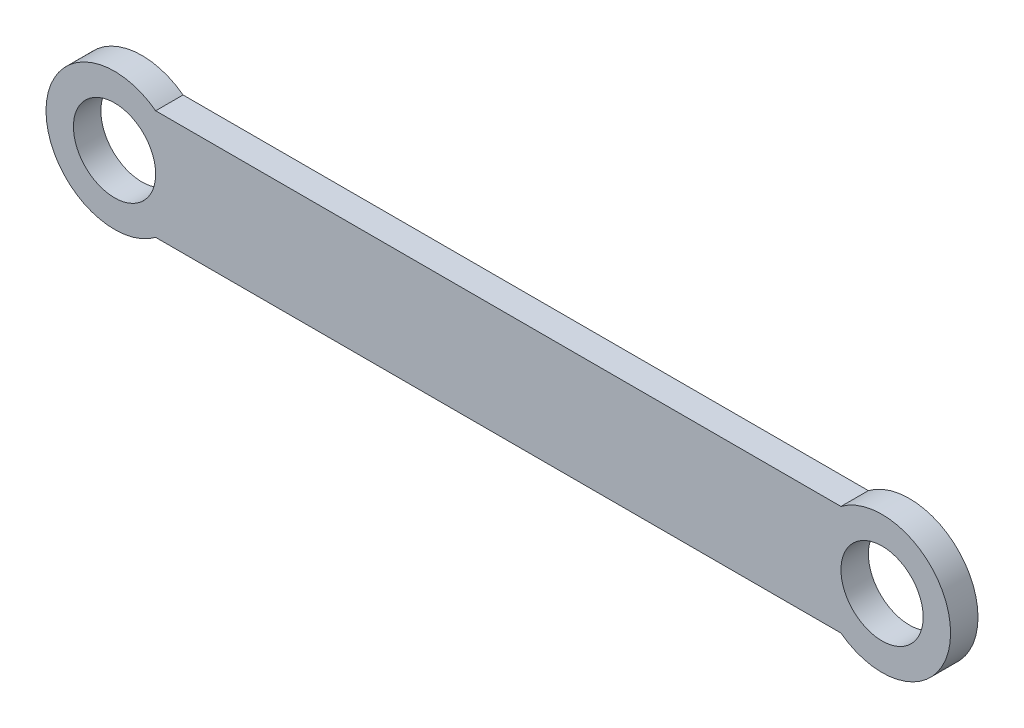
ISO-10303-21;
HEADER;
FILE_DESCRIPTION(('STEP AP214'),'2;1');
FILE_NAME('part.step','',(''),(''),'','','');
FILE_SCHEMA(('AUTOMOTIVE_DESIGN { 1 0 10303 214 1 1 1 1 }'));
ENDSEC;
DATA;
#1=APPLICATION_CONTEXT('core data for automotive mechanical design processes');
#2=APPLICATION_PROTOCOL_DEFINITION('international standard','automotive_design',2000,#1);
#3=PRODUCT_CONTEXT('',#1,'mechanical');
#4=PRODUCT('Part','Part','',(#3));
#5=PRODUCT_RELATED_PRODUCT_CATEGORY('part','',(#4));
#6=PRODUCT_DEFINITION_FORMATION('','',#4);
#7=PRODUCT_DEFINITION_CONTEXT('part definition',#1,'design');
#8=PRODUCT_DEFINITION('design','',#6,#7);
#9=PRODUCT_DEFINITION_SHAPE('','',#8);
#10=(LENGTH_UNIT() NAMED_UNIT(*) SI_UNIT(.MILLI.,.METRE.));
#11=(NAMED_UNIT(*) PLANE_ANGLE_UNIT() SI_UNIT($,.RADIAN.));
#12=(NAMED_UNIT(*) SI_UNIT($,.STERADIAN.) SOLID_ANGLE_UNIT());
#13=UNCERTAINTY_MEASURE_WITH_UNIT(LENGTH_MEASURE(1.E-05),#10,'distance_accuracy_value','');
#14=(GEOMETRIC_REPRESENTATION_CONTEXT(3) GLOBAL_UNCERTAINTY_ASSIGNED_CONTEXT((#13)) GLOBAL_UNIT_ASSIGNED_CONTEXT((#10,
#11,#12)) REPRESENTATION_CONTEXT('',''));
#15=CARTESIAN_POINT('',(0.,0.,0.));
#16=DIRECTION('',(0.,0.,1.));
#17=DIRECTION('',(1.,0.,0.));
#18=AXIS2_PLACEMENT_3D('',#15,#16,#17);
#19=CARTESIAN_POINT('',(49.0897558478484,0.198128930903584,1.));
#20=DIRECTION('',(0.,0.,1.));
#21=DIRECTION('',(1.,0.,0.));
#22=AXIS2_PLACEMENT_3D('',#19,#20,#21);
#23=PLANE('',#22);
#24=CARTESIAN_POINT('',(49.0897558478484,0.198128930903584,1.));
#25=DIRECTION('',(0.,0.,1.));
#26=DIRECTION('',(1.,0.,0.));
#27=AXIS2_PLACEMENT_3D('',#24,#25,#26);
#28=CIRCLE('',#27,1.5);
#29=CARTESIAN_POINT('',(50.5897558478484,0.198128930903584,1.));
#30=VERTEX_POINT('',#29);
#31=EDGE_CURVE('E98',#30,#30,#28,.T.);
#32=ORIENTED_EDGE('',*,*,#31,.F.);
#33=EDGE_LOOP('',(#32));
#34=FACE_BOUND('',#33,.T.);
#35=CARTESIAN_POINT('',(49.0897558478484,0.198128930903584,1.));
#36=DIRECTION('',(0.,0.,1.));
#37=DIRECTION('',(1.,0.,0.));
#38=AXIS2_PLACEMENT_3D('',#35,#36,#37);
#39=CIRCLE('',#38,2.5);
#40=CARTESIAN_POINT('',(47.5897558478484,-1.80187106909642,1.));
#41=VERTEX_POINT('',#40);
#42=CARTESIAN_POINT('',(47.5897558478484,2.19812893090358,1.));
#43=VERTEX_POINT('',#42);
#44=EDGE_CURVE('E83',#41,#43,#39,.T.);
#45=ORIENTED_EDGE('',*,*,#44,.T.);
#46=DIRECTION('',(-1.,0.,0.));
#47=VECTOR('',#46,1.);
#48=CARTESIAN_POINT('',(22.5897558478484,2.19812893090358,1.));
#49=LINE('',#48,#47);
#50=CARTESIAN_POINT('',(22.5897558478484,2.19812893090358,1.));
#51=VERTEX_POINT('',#50);
#52=EDGE_CURVE('E78',#43,#51,#49,.T.);
#53=ORIENTED_EDGE('',*,*,#52,.T.);
#54=CARTESIAN_POINT('',(21.0897558478484,0.198128930903581,1.));
#55=DIRECTION('',(0.,0.,1.));
#56=DIRECTION('',(1.,0.,0.));
#57=AXIS2_PLACEMENT_3D('',#54,#55,#56);
#58=CIRCLE('',#57,2.5);
#59=CARTESIAN_POINT('',(22.5897558478484,-1.80187106909642,1.));
#60=VERTEX_POINT('',#59);
#61=EDGE_CURVE('E81',#51,#60,#58,.T.);
#62=ORIENTED_EDGE('',*,*,#61,.T.);
#63=DIRECTION('',(1.,0.,0.));
#64=VECTOR('',#63,1.);
#65=CARTESIAN_POINT('',(22.5897558478484,-1.80187106909642,1.));
#66=LINE('',#65,#64);
#67=EDGE_CURVE('E48',#60,#41,#66,.T.);
#68=ORIENTED_EDGE('',*,*,#67,.T.);
#69=EDGE_LOOP('',(#45,#53,#62,#68));
#70=FACE_BOUND('',#69,.T.);
#71=CARTESIAN_POINT('',(21.0897558478484,0.198128930903581,1.));
#72=DIRECTION('',(0.,0.,1.));
#73=DIRECTION('',(1.,0.,0.));
#74=AXIS2_PLACEMENT_3D('',#71,#72,#73);
#75=CIRCLE('',#74,1.5);
#76=CARTESIAN_POINT('',(22.5897558478484,0.198128930903581,1.));
#77=VERTEX_POINT('',#76);
#78=EDGE_CURVE('E113',#77,#77,#75,.T.);
#79=ORIENTED_EDGE('',*,*,#78,.F.);
#80=EDGE_LOOP('',(#79));
#81=FACE_BOUND('',#80,.T.);
#82=ADVANCED_FACE('F31',(#34,#70,#81),#23,.T.);
#83=CARTESIAN_POINT('',(49.0897558478484,0.198128930903584,0.));
#84=DIRECTION('',(0.,0.,1.));
#85=DIRECTION('',(1.,0.,0.));
#86=AXIS2_PLACEMENT_3D('',#83,#84,#85);
#87=PLANE('',#86);
#88=CARTESIAN_POINT('',(49.0897558478484,0.198128930903584,0.));
#89=DIRECTION('',(0.,0.,1.));
#90=DIRECTION('',(1.,0.,0.));
#91=AXIS2_PLACEMENT_3D('',#88,#89,#90);
#92=CIRCLE('',#91,1.5);
#93=CARTESIAN_POINT('',(50.5897558478484,0.198128930903584,0.));
#94=VERTEX_POINT('',#93);
#95=EDGE_CURVE('E110',#94,#94,#92,.T.);
#96=ORIENTED_EDGE('',*,*,#95,.T.);
#97=EDGE_LOOP('',(#96));
#98=FACE_BOUND('',#97,.T.);
#99=CARTESIAN_POINT('',(49.0897558478484,0.198128930903584,0.));
#100=DIRECTION('',(0.,0.,1.));
#101=DIRECTION('',(1.,0.,0.));
#102=AXIS2_PLACEMENT_3D('',#99,#100,#101);
#103=CIRCLE('',#102,2.5);
#104=CARTESIAN_POINT('',(47.5897558478484,-1.80187106909642,0.));
#105=VERTEX_POINT('',#104);
#106=CARTESIAN_POINT('',(47.5897558478484,2.19812893090358,0.));
#107=VERTEX_POINT('',#106);
#108=EDGE_CURVE('E95',#105,#107,#103,.T.);
#109=ORIENTED_EDGE('',*,*,#108,.F.);
#110=DIRECTION('',(1.,0.,0.));
#111=VECTOR('',#110,1.);
#112=CARTESIAN_POINT('',(22.5897558478484,-1.80187106909642,0.));
#113=LINE('',#112,#111);
#114=CARTESIAN_POINT('',(22.5897558478484,-1.80187106909642,0.));
#115=VERTEX_POINT('',#114);
#116=EDGE_CURVE('E71',#115,#105,#113,.T.);
#117=ORIENTED_EDGE('',*,*,#116,.F.);
#118=CARTESIAN_POINT('',(21.0897558478484,0.198128930903581,0.));
#119=DIRECTION('',(0.,0.,1.));
#120=DIRECTION('',(1.,0.,0.));
#121=AXIS2_PLACEMENT_3D('',#118,#119,#120);
#122=CIRCLE('',#121,2.5);
#123=CARTESIAN_POINT('',(22.5897558478484,2.19812893090358,0.));
#124=VERTEX_POINT('',#123);
#125=EDGE_CURVE('E65',#124,#115,#122,.T.);
#126=ORIENTED_EDGE('',*,*,#125,.F.);
#127=DIRECTION('',(-1.,0.,0.));
#128=VECTOR('',#127,1.);
#129=CARTESIAN_POINT('',(22.5897558478484,2.19812893090358,0.));
#130=LINE('',#129,#128);
#131=EDGE_CURVE('E87',#107,#124,#130,.T.);
#132=ORIENTED_EDGE('',*,*,#131,.F.);
#133=EDGE_LOOP('',(#109,#117,#126,#132));
#134=FACE_BOUND('',#133,.T.);
#135=CARTESIAN_POINT('',(21.0897558478484,0.198128930903581,0.));
#136=DIRECTION('',(0.,0.,1.));
#137=DIRECTION('',(1.,0.,0.));
#138=AXIS2_PLACEMENT_3D('',#135,#136,#137);
#139=CIRCLE('',#138,1.5);
#140=CARTESIAN_POINT('',(22.5897558478484,0.198128930903581,0.));
#141=VERTEX_POINT('',#140);
#142=EDGE_CURVE('E116',#141,#141,#139,.T.);
#143=ORIENTED_EDGE('',*,*,#142,.T.);
#144=EDGE_LOOP('',(#143));
#145=FACE_BOUND('',#144,.T.);
#146=ADVANCED_FACE('F106',(#98,#134,#145),#87,.F.);
#147=CARTESIAN_POINT('',(49.0897558478484,0.198128930903584,1.));
#148=DIRECTION('',(0.,0.,-1.));
#149=DIRECTION('',(-1.,0.,0.));
#150=AXIS2_PLACEMENT_3D('',#147,#148,#149);
#151=CYLINDRICAL_SURFACE('',#150,2.5);
#152=ORIENTED_EDGE('',*,*,#108,.T.);
#153=DIRECTION('',(0.,0.,-1.));
#154=VECTOR('',#153,1.);
#155=CARTESIAN_POINT('',(47.5897558478484,2.19812893090358,1.));
#156=LINE('',#155,#154);
#157=EDGE_CURVE('E11',#43,#107,#156,.T.);
#158=ORIENTED_EDGE('',*,*,#157,.F.);
#159=ORIENTED_EDGE('',*,*,#44,.F.);
#160=DIRECTION('',(0.,0.,-1.));
#161=VECTOR('',#160,1.);
#162=CARTESIAN_POINT('',(47.5897558478484,-1.80187106909642,1.));
#163=LINE('',#162,#161);
#164=EDGE_CURVE('E91',#41,#105,#163,.T.);
#165=ORIENTED_EDGE('',*,*,#164,.T.);
#166=EDGE_LOOP('',(#152,#158,#159,#165));
#167=FACE_BOUND('',#166,.T.);
#168=ADVANCED_FACE('F33',(#167),#151,.T.);
#169=CARTESIAN_POINT('',(22.5897558478484,2.19812893090358,1.));
#170=DIRECTION('',(0.,-1.,0.));
#171=DIRECTION('',(1.,0.,0.));
#172=AXIS2_PLACEMENT_3D('',#169,#170,#171);
#173=PLANE('',#172);
#174=ORIENTED_EDGE('',*,*,#131,.T.);
#175=DIRECTION('',(0.,0.,-1.));
#176=VECTOR('',#175,1.);
#177=CARTESIAN_POINT('',(22.5897558478484,2.19812893090358,1.));
#178=LINE('',#177,#176);
#179=EDGE_CURVE('E40',#51,#124,#178,.T.);
#180=ORIENTED_EDGE('',*,*,#179,.F.);
#181=ORIENTED_EDGE('',*,*,#52,.F.);
#182=ORIENTED_EDGE('',*,*,#157,.T.);
#183=EDGE_LOOP('',(#174,#180,#181,#182));
#184=FACE_BOUND('',#183,.T.);
#185=ADVANCED_FACE('F86',(#184),#173,.F.);
#186=CARTESIAN_POINT('',(21.0897558478484,0.198128930903581,1.));
#187=DIRECTION('',(0.,0.,-1.));
#188=DIRECTION('',(-1.,0.,0.));
#189=AXIS2_PLACEMENT_3D('',#186,#187,#188);
#190=CYLINDRICAL_SURFACE('',#189,2.5);
#191=ORIENTED_EDGE('',*,*,#125,.T.);
#192=DIRECTION('',(0.,0.,-1.));
#193=VECTOR('',#192,1.);
#194=CARTESIAN_POINT('',(22.5897558478484,-1.80187106909642,1.));
#195=LINE('',#194,#193);
#196=EDGE_CURVE('E88',#60,#115,#195,.T.);
#197=ORIENTED_EDGE('',*,*,#196,.F.);
#198=ORIENTED_EDGE('',*,*,#61,.F.);
#199=ORIENTED_EDGE('',*,*,#179,.T.);
#200=EDGE_LOOP('',(#191,#197,#198,#199));
#201=FACE_BOUND('',#200,.T.);
#202=ADVANCED_FACE('F89',(#201),#190,.T.);
#203=CARTESIAN_POINT('',(22.5897558478484,-1.80187106909642,1.));
#204=DIRECTION('',(0.,1.,0.));
#205=DIRECTION('',(-1.,0.,0.));
#206=AXIS2_PLACEMENT_3D('',#203,#204,#205);
#207=PLANE('',#206);
#208=ORIENTED_EDGE('',*,*,#116,.T.);
#209=ORIENTED_EDGE('',*,*,#164,.F.);
#210=ORIENTED_EDGE('',*,*,#67,.F.);
#211=ORIENTED_EDGE('',*,*,#196,.T.);
#212=EDGE_LOOP('',(#208,#209,#210,#211));
#213=FACE_BOUND('',#212,.T.);
#214=ADVANCED_FACE('F103',(#213),#207,.F.);
#215=CARTESIAN_POINT('',(49.0897558478484,0.198128930903584,1.));
#216=DIRECTION('',(0.,0.,-1.));
#217=DIRECTION('',(-1.,0.,0.));
#218=AXIS2_PLACEMENT_3D('',#215,#216,#217);
#219=CYLINDRICAL_SURFACE('',#218,1.5);
#220=ORIENTED_EDGE('',*,*,#31,.T.);
#221=EDGE_LOOP('',(#220));
#222=FACE_BOUND('',#221,.T.);
#223=ORIENTED_EDGE('',*,*,#95,.F.);
#224=EDGE_LOOP('',(#223));
#225=FACE_BOUND('',#224,.T.);
#226=ADVANCED_FACE('F134',(#222,#225),#219,.F.);
#227=CARTESIAN_POINT('',(21.0897558478484,0.198128930903581,1.));
#228=DIRECTION('',(0.,0.,-1.));
#229=DIRECTION('',(-1.,0.,0.));
#230=AXIS2_PLACEMENT_3D('',#227,#228,#229);
#231=CYLINDRICAL_SURFACE('',#230,1.5);
#232=ORIENTED_EDGE('',*,*,#78,.T.);
#233=EDGE_LOOP('',(#232));
#234=FACE_BOUND('',#233,.T.);
#235=ORIENTED_EDGE('',*,*,#142,.F.);
#236=EDGE_LOOP('',(#235));
#237=FACE_BOUND('',#236,.T.);
#238=ADVANCED_FACE('F122',(#234,#237),#231,.F.);
#239=CLOSED_SHELL('',(#82,#146,#168,#185,#202,#214,#226,#238));
#240=MANIFOLD_SOLID_BREP('B2',#239);
#241=ADVANCED_BREP_SHAPE_REPRESENTATION('',(#18,#240),#14);
#242=SHAPE_DEFINITION_REPRESENTATION(#9,#241);
ENDSEC;
END-ISO-10303-21;
